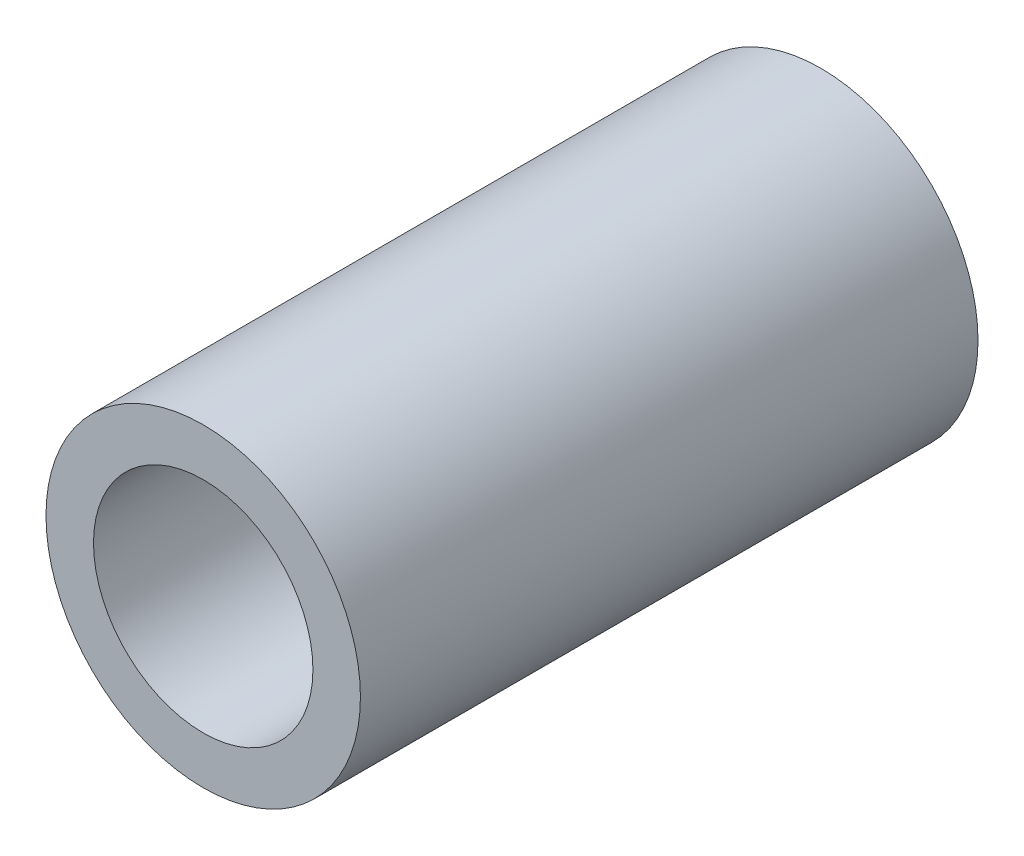
ISO-10303-21;
HEADER;
FILE_DESCRIPTION(('STEP AP214'),'2;1');
FILE_NAME('part.step','',(''),(''),'','','');
FILE_SCHEMA(('AUTOMOTIVE_DESIGN { 1 0 10303 214 1 1 1 1 }'));
ENDSEC;
DATA;
#1=APPLICATION_CONTEXT('core data for automotive mechanical design processes');
#2=APPLICATION_PROTOCOL_DEFINITION('international standard','automotive_design',2000,#1);
#3=PRODUCT_CONTEXT('',#1,'mechanical');
#4=PRODUCT('Part','Part','',(#3));
#5=PRODUCT_RELATED_PRODUCT_CATEGORY('part','',(#4));
#6=PRODUCT_DEFINITION_FORMATION('','',#4);
#7=PRODUCT_DEFINITION_CONTEXT('part definition',#1,'design');
#8=PRODUCT_DEFINITION('design','',#6,#7);
#9=PRODUCT_DEFINITION_SHAPE('','',#8);
#10=(LENGTH_UNIT() NAMED_UNIT(*) SI_UNIT(.MILLI.,.METRE.));
#11=(NAMED_UNIT(*) PLANE_ANGLE_UNIT() SI_UNIT($,.RADIAN.));
#12=(NAMED_UNIT(*) SI_UNIT($,.STERADIAN.) SOLID_ANGLE_UNIT());
#13=UNCERTAINTY_MEASURE_WITH_UNIT(LENGTH_MEASURE(1.E-05),#10,'distance_accuracy_value','');
#14=(GEOMETRIC_REPRESENTATION_CONTEXT(3) GLOBAL_UNCERTAINTY_ASSIGNED_CONTEXT((#13)) GLOBAL_UNIT_ASSIGNED_CONTEXT((#10,
#11,#12)) REPRESENTATION_CONTEXT('',''));
#15=CARTESIAN_POINT('',(0.,0.,0.));
#16=DIRECTION('',(0.,0.,1.));
#17=DIRECTION('',(1.,0.,0.));
#18=AXIS2_PLACEMENT_3D('',#15,#16,#17);
#19=CARTESIAN_POINT('',(0.,0.,41.275));
#20=DIRECTION('',(0.,0.,-1.));
#21=DIRECTION('',(-1.,0.,0.));
#22=AXIS2_PLACEMENT_3D('',#19,#20,#21);
#23=CYLINDRICAL_SURFACE('',#22,7.33234841870825);
#24=CARTESIAN_POINT('',(0.,0.,41.275));
#25=DIRECTION('',(0.,0.,1.));
#26=DIRECTION('',(1.,0.,0.));
#27=AXIS2_PLACEMENT_3D('',#24,#25,#26);
#28=CIRCLE('',#27,7.33234841870825);
#29=CARTESIAN_POINT('',(7.33234841870825,0.,41.275));
#30=VERTEX_POINT('',#29);
#31=EDGE_CURVE('E41',#30,#30,#28,.T.);
#32=ORIENTED_EDGE('',*,*,#31,.T.);
#33=EDGE_LOOP('',(#32));
#34=FACE_BOUND('',#33,.T.);
#35=CARTESIAN_POINT('',(0.,0.,0.));
#36=DIRECTION('',(0.,0.,1.));
#37=DIRECTION('',(1.,0.,0.));
#38=AXIS2_PLACEMENT_3D('',#35,#36,#37);
#39=CIRCLE('',#38,7.33234841870825);
#40=CARTESIAN_POINT('',(7.33234841870825,0.,0.));
#41=VERTEX_POINT('',#40);
#42=EDGE_CURVE('E47',#41,#41,#39,.T.);
#43=ORIENTED_EDGE('',*,*,#42,.F.);
#44=EDGE_LOOP('',(#43));
#45=FACE_BOUND('',#44,.T.);
#46=ADVANCED_FACE('F34',(#34,#45),#23,.F.);
#47=CARTESIAN_POINT('',(0.,0.,41.275));
#48=DIRECTION('',(0.,0.,-1.));
#49=DIRECTION('',(-1.,0.,0.));
#50=AXIS2_PLACEMENT_3D('',#47,#48,#49);
#51=CYLINDRICAL_SURFACE('',#50,10.5073484187082);
#52=CARTESIAN_POINT('',(0.,0.,41.275));
#53=DIRECTION('',(0.,0.,1.));
#54=DIRECTION('',(1.,0.,0.));
#55=AXIS2_PLACEMENT_3D('',#52,#53,#54);
#56=CIRCLE('',#55,10.5073484187082);
#57=CARTESIAN_POINT('',(10.5073484187082,0.,41.275));
#58=VERTEX_POINT('',#57);
#59=EDGE_CURVE('E10',#58,#58,#56,.T.);
#60=ORIENTED_EDGE('',*,*,#59,.F.);
#61=EDGE_LOOP('',(#60));
#62=FACE_BOUND('',#61,.T.);
#63=CARTESIAN_POINT('',(0.,0.,0.));
#64=DIRECTION('',(0.,0.,1.));
#65=DIRECTION('',(1.,0.,0.));
#66=AXIS2_PLACEMENT_3D('',#63,#64,#65);
#67=CIRCLE('',#66,10.5073484187082);
#68=CARTESIAN_POINT('',(10.5073484187082,0.,0.));
#69=VERTEX_POINT('',#68);
#70=EDGE_CURVE('E37',#69,#69,#67,.T.);
#71=ORIENTED_EDGE('',*,*,#70,.T.);
#72=EDGE_LOOP('',(#71));
#73=FACE_BOUND('',#72,.T.);
#74=ADVANCED_FACE('F54',(#62,#73),#51,.T.);
#75=CARTESIAN_POINT('',(0.,0.,41.275));
#76=DIRECTION('',(0.,0.,1.));
#77=DIRECTION('',(1.,0.,0.));
#78=AXIS2_PLACEMENT_3D('',#75,#76,#77);
#79=PLANE('',#78);
#80=ORIENTED_EDGE('',*,*,#31,.F.);
#81=EDGE_LOOP('',(#80));
#82=FACE_BOUND('',#81,.T.);
#83=ORIENTED_EDGE('',*,*,#59,.T.);
#84=EDGE_LOOP('',(#83));
#85=FACE_BOUND('',#84,.T.);
#86=ADVANCED_FACE('F58',(#82,#85),#79,.T.);
#87=CARTESIAN_POINT('',(0.,0.,0.));
#88=DIRECTION('',(0.,0.,1.));
#89=DIRECTION('',(1.,0.,0.));
#90=AXIS2_PLACEMENT_3D('',#87,#88,#89);
#91=PLANE('',#90);
#92=ORIENTED_EDGE('',*,*,#42,.T.);
#93=EDGE_LOOP('',(#92));
#94=FACE_BOUND('',#93,.T.);
#95=ORIENTED_EDGE('',*,*,#70,.F.);
#96=EDGE_LOOP('',(#95));
#97=FACE_BOUND('',#96,.T.);
#98=ADVANCED_FACE('F56',(#94,#97),#91,.F.);
#99=CLOSED_SHELL('',(#46,#74,#86,#98));
#100=MANIFOLD_SOLID_BREP('B2',#99);
#101=ADVANCED_BREP_SHAPE_REPRESENTATION('',(#18,#100),#14);
#102=SHAPE_DEFINITION_REPRESENTATION(#9,#101);
ENDSEC;
END-ISO-10303-21;
